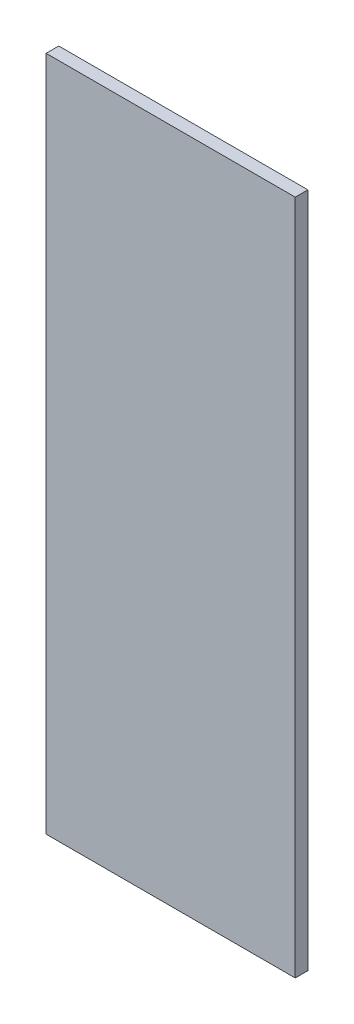
ISO-10303-21;
HEADER;
FILE_DESCRIPTION(('STEP AP214'),'2;1');
FILE_NAME('part.step','',(''),(''),'','','');
FILE_SCHEMA(('AUTOMOTIVE_DESIGN { 1 0 10303 214 1 1 1 1 }'));
ENDSEC;
DATA;
#1=APPLICATION_CONTEXT('core data for automotive mechanical design processes');
#2=APPLICATION_PROTOCOL_DEFINITION('international standard','automotive_design',2000,#1);
#3=PRODUCT_CONTEXT('',#1,'mechanical');
#4=PRODUCT('Part','Part','',(#3));
#5=PRODUCT_RELATED_PRODUCT_CATEGORY('part','',(#4));
#6=PRODUCT_DEFINITION_FORMATION('','',#4);
#7=PRODUCT_DEFINITION_CONTEXT('part definition',#1,'design');
#8=PRODUCT_DEFINITION('design','',#6,#7);
#9=PRODUCT_DEFINITION_SHAPE('','',#8);
#10=(LENGTH_UNIT() NAMED_UNIT(*) SI_UNIT(.MILLI.,.METRE.));
#11=(NAMED_UNIT(*) PLANE_ANGLE_UNIT() SI_UNIT($,.RADIAN.));
#12=(NAMED_UNIT(*) SI_UNIT($,.STERADIAN.) SOLID_ANGLE_UNIT());
#13=UNCERTAINTY_MEASURE_WITH_UNIT(LENGTH_MEASURE(1.E-05),#10,'distance_accuracy_value','');
#14=(GEOMETRIC_REPRESENTATION_CONTEXT(3) GLOBAL_UNCERTAINTY_ASSIGNED_CONTEXT((#13)) GLOBAL_UNIT_ASSIGNED_CONTEXT((#10,
#11,#12)) REPRESENTATION_CONTEXT('',''));
#15=CARTESIAN_POINT('',(0.,0.,0.));
#16=DIRECTION('',(0.,0.,1.));
#17=DIRECTION('',(1.,0.,0.));
#18=AXIS2_PLACEMENT_3D('',#15,#16,#17);
#19=CARTESIAN_POINT('',(87.9420013427734,53.8279991149902,0.));
#20=DIRECTION('',(1.,0.,0.));
#21=DIRECTION('',(0.,-1.,0.));
#22=AXIS2_PLACEMENT_3D('',#19,#20,#21);
#23=PLANE('',#22);
#24=DIRECTION('',(0.,-1.,0.));
#25=VECTOR('',#24,1.);
#26=CARTESIAN_POINT('',(87.9420013427734,53.8279991149902,0.03556));
#27=LINE('',#26,#25);
#28=CARTESIAN_POINT('',(87.9420013427734,53.8279991149902,0.03556));
#29=VERTEX_POINT('',#28);
#30=CARTESIAN_POINT('',(87.9420013427734,51.9280014038086,0.03556));
#31=VERTEX_POINT('',#30);
#32=EDGE_CURVE('E11',#29,#31,#27,.T.);
#33=ORIENTED_EDGE('',*,*,#32,.F.);
#34=DIRECTION('',(0.,0.,1.));
#35=VECTOR('',#34,1.);
#36=CARTESIAN_POINT('',(87.9420013427734,53.8279991149902,0.));
#37=LINE('',#36,#35);
#38=CARTESIAN_POINT('',(87.9420013427734,53.8279991149902,0.));
#39=VERTEX_POINT('',#38);
#40=EDGE_CURVE('E24',#39,#29,#37,.T.);
#41=ORIENTED_EDGE('',*,*,#40,.F.);
#42=DIRECTION('',(0.,-1.,0.));
#43=VECTOR('',#42,1.);
#44=CARTESIAN_POINT('',(87.9420013427734,53.8279991149902,0.));
#45=LINE('',#44,#43);
#46=CARTESIAN_POINT('',(87.9420013427734,51.9280014038086,0.));
#47=VERTEX_POINT('',#46);
#48=EDGE_CURVE('E75',#39,#47,#45,.T.);
#49=ORIENTED_EDGE('',*,*,#48,.T.);
#50=DIRECTION('',(0.,0.,1.));
#51=VECTOR('',#50,1.);
#52=CARTESIAN_POINT('',(87.9420013427734,51.9280014038086,0.));
#53=LINE('',#52,#51);
#54=EDGE_CURVE('E37',#47,#31,#53,.T.);
#55=ORIENTED_EDGE('',*,*,#54,.T.);
#56=EDGE_LOOP('',(#33,#41,#49,#55));
#57=FACE_BOUND('',#56,.T.);
#58=ADVANCED_FACE('F17',(#57),#23,.F.);
#59=CARTESIAN_POINT('',(87.9420013427734,51.9280014038086,0.));
#60=DIRECTION('',(0.,1.,0.));
#61=DIRECTION('',(1.,0.,0.));
#62=AXIS2_PLACEMENT_3D('',#59,#60,#61);
#63=PLANE('',#62);
#64=DIRECTION('',(1.,0.,0.));
#65=VECTOR('',#64,1.);
#66=CARTESIAN_POINT('',(87.9420013427734,51.9280014038086,0.03556));
#67=LINE('',#66,#65);
#68=CARTESIAN_POINT('',(88.6419982910156,51.9280014038086,0.03556));
#69=VERTEX_POINT('',#68);
#70=EDGE_CURVE('E83',#31,#69,#67,.T.);
#71=ORIENTED_EDGE('',*,*,#70,.F.);
#72=ORIENTED_EDGE('',*,*,#54,.F.);
#73=DIRECTION('',(1.,0.,0.));
#74=VECTOR('',#73,1.);
#75=CARTESIAN_POINT('',(87.9420013427734,51.9280014038086,0.));
#76=LINE('',#75,#74);
#77=CARTESIAN_POINT('',(88.6419982910156,51.9280014038086,0.));
#78=VERTEX_POINT('',#77);
#79=EDGE_CURVE('E81',#47,#78,#76,.T.);
#80=ORIENTED_EDGE('',*,*,#79,.T.);
#81=DIRECTION('',(0.,0.,1.));
#82=VECTOR('',#81,1.);
#83=CARTESIAN_POINT('',(88.6419982910156,51.9280014038086,0.));
#84=LINE('',#83,#82);
#85=EDGE_CURVE('E67',#78,#69,#84,.T.);
#86=ORIENTED_EDGE('',*,*,#85,.T.);
#87=EDGE_LOOP('',(#71,#72,#80,#86));
#88=FACE_BOUND('',#87,.T.);
#89=ADVANCED_FACE('F89',(#88),#63,.F.);
#90=CARTESIAN_POINT('',(88.6419982910156,51.9280014038086,0.));
#91=DIRECTION('',(-1.,0.,0.));
#92=DIRECTION('',(0.,1.,0.));
#93=AXIS2_PLACEMENT_3D('',#90,#91,#92);
#94=PLANE('',#93);
#95=DIRECTION('',(0.,1.,0.));
#96=VECTOR('',#95,1.);
#97=CARTESIAN_POINT('',(88.6419982910156,51.9280014038086,0.03556));
#98=LINE('',#97,#96);
#99=CARTESIAN_POINT('',(88.6419982910156,53.8279991149902,0.03556));
#100=VERTEX_POINT('',#99);
#101=EDGE_CURVE('E71',#69,#100,#98,.T.);
#102=ORIENTED_EDGE('',*,*,#101,.F.);
#103=ORIENTED_EDGE('',*,*,#85,.F.);
#104=DIRECTION('',(0.,1.,0.));
#105=VECTOR('',#104,1.);
#106=CARTESIAN_POINT('',(88.6419982910156,51.9280014038086,0.));
#107=LINE('',#106,#105);
#108=CARTESIAN_POINT('',(88.6419982910156,53.8279991149902,0.));
#109=VERTEX_POINT('',#108);
#110=EDGE_CURVE('E63',#78,#109,#107,.T.);
#111=ORIENTED_EDGE('',*,*,#110,.T.);
#112=DIRECTION('',(0.,0.,1.));
#113=VECTOR('',#112,1.);
#114=CARTESIAN_POINT('',(88.6419982910156,53.8279991149902,0.));
#115=LINE('',#114,#113);
#116=EDGE_CURVE('E53',#109,#100,#115,.T.);
#117=ORIENTED_EDGE('',*,*,#116,.T.);
#118=EDGE_LOOP('',(#102,#103,#111,#117));
#119=FACE_BOUND('',#118,.T.);
#120=ADVANCED_FACE('F66',(#119),#94,.F.);
#121=CARTESIAN_POINT('',(88.6419982910156,53.8279991149902,0.));
#122=DIRECTION('',(0.,-1.,0.));
#123=DIRECTION('',(-1.,0.,0.));
#124=AXIS2_PLACEMENT_3D('',#121,#122,#123);
#125=PLANE('',#124);
#126=DIRECTION('',(-1.,0.,0.));
#127=VECTOR('',#126,1.);
#128=CARTESIAN_POINT('',(88.6419982910156,53.8279991149902,0.03556));
#129=LINE('',#128,#127);
#130=EDGE_CURVE('E59',#100,#29,#129,.T.);
#131=ORIENTED_EDGE('',*,*,#130,.F.);
#132=ORIENTED_EDGE('',*,*,#116,.F.);
#133=DIRECTION('',(-1.,0.,0.));
#134=VECTOR('',#133,1.);
#135=CARTESIAN_POINT('',(88.6419982910156,53.8279991149902,0.));
#136=LINE('',#135,#134);
#137=EDGE_CURVE('E57',#109,#39,#136,.T.);
#138=ORIENTED_EDGE('',*,*,#137,.T.);
#139=ORIENTED_EDGE('',*,*,#40,.T.);
#140=EDGE_LOOP('',(#131,#132,#138,#139));
#141=FACE_BOUND('',#140,.T.);
#142=ADVANCED_FACE('F55',(#141),#125,.F.);
#143=CARTESIAN_POINT('',(87.9420013427734,53.8279991149902,0.));
#144=DIRECTION('',(0.,0.,-1.));
#145=DIRECTION('',(-1.,0.,0.));
#146=AXIS2_PLACEMENT_3D('',#143,#144,#145);
#147=PLANE('',#146);
#148=ORIENTED_EDGE('',*,*,#137,.F.);
#149=ORIENTED_EDGE('',*,*,#110,.F.);
#150=ORIENTED_EDGE('',*,*,#79,.F.);
#151=ORIENTED_EDGE('',*,*,#48,.F.);
#152=EDGE_LOOP('',(#148,#149,#150,#151));
#153=FACE_BOUND('',#152,.T.);
#154=ADVANCED_FACE('F74',(#153),#147,.T.);
#155=CARTESIAN_POINT('',(87.9420013427734,53.8279991149902,0.03556));
#156=DIRECTION('',(0.,0.,-1.));
#157=DIRECTION('',(-1.,0.,0.));
#158=AXIS2_PLACEMENT_3D('',#155,#156,#157);
#159=PLANE('',#158);
#160=ORIENTED_EDGE('',*,*,#32,.T.);
#161=ORIENTED_EDGE('',*,*,#70,.T.);
#162=ORIENTED_EDGE('',*,*,#101,.T.);
#163=ORIENTED_EDGE('',*,*,#130,.T.);
#164=EDGE_LOOP('',(#160,#161,#162,#163));
#165=FACE_BOUND('',#164,.T.);
#166=ADVANCED_FACE('F91',(#165),#159,.F.);
#167=CLOSED_SHELL('',(#58,#89,#120,#142,#154,#166));
#168=MANIFOLD_SOLID_BREP('B1',#167);
#169=ADVANCED_BREP_SHAPE_REPRESENTATION('',(#18,#168),#14);
#170=SHAPE_DEFINITION_REPRESENTATION(#9,#169);
ENDSEC;
END-ISO-10303-21;
